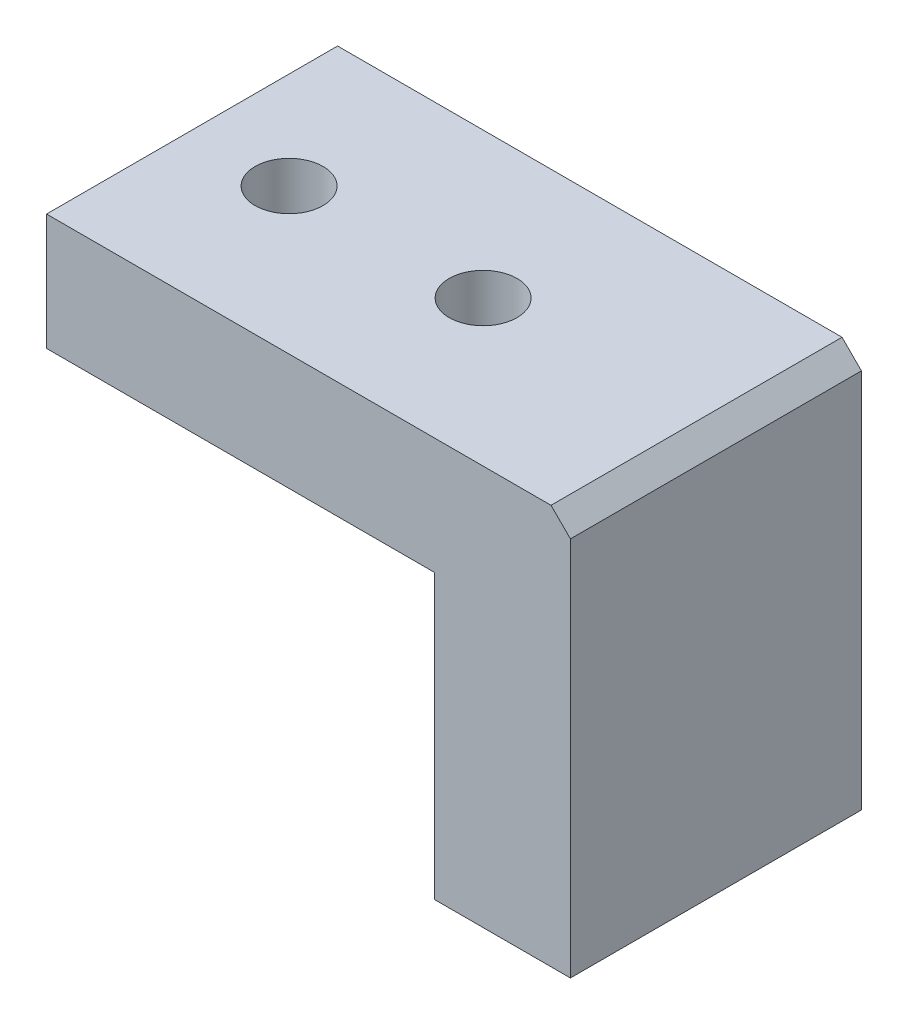
ISO-10303-21;
HEADER;
FILE_DESCRIPTION(('STEP AP214'),'2;1');
FILE_NAME('part.step','',(''),(''),'','','');
FILE_SCHEMA(('AUTOMOTIVE_DESIGN { 1 0 10303 214 1 1 1 1 }'));
ENDSEC;
DATA;
#1=APPLICATION_CONTEXT('core data for automotive mechanical design processes');
#2=APPLICATION_PROTOCOL_DEFINITION('international standard','automotive_design',2000,#1);
#3=PRODUCT_CONTEXT('',#1,'mechanical');
#4=PRODUCT('Part','Part','',(#3));
#5=PRODUCT_RELATED_PRODUCT_CATEGORY('part','',(#4));
#6=PRODUCT_DEFINITION_FORMATION('','',#4);
#7=PRODUCT_DEFINITION_CONTEXT('part definition',#1,'design');
#8=PRODUCT_DEFINITION('design','',#6,#7);
#9=PRODUCT_DEFINITION_SHAPE('','',#8);
#10=(LENGTH_UNIT() NAMED_UNIT(*) SI_UNIT(.MILLI.,.METRE.));
#11=(NAMED_UNIT(*) PLANE_ANGLE_UNIT() SI_UNIT($,.RADIAN.));
#12=(NAMED_UNIT(*) SI_UNIT($,.STERADIAN.) SOLID_ANGLE_UNIT());
#13=UNCERTAINTY_MEASURE_WITH_UNIT(LENGTH_MEASURE(1.E-05),#10,'distance_accuracy_value','');
#14=(GEOMETRIC_REPRESENTATION_CONTEXT(3) GLOBAL_UNCERTAINTY_ASSIGNED_CONTEXT((#13)) GLOBAL_UNIT_ASSIGNED_CONTEXT((#10,
#11,#12)) REPRESENTATION_CONTEXT('',''));
#15=CARTESIAN_POINT('',(0.,0.,0.));
#16=DIRECTION('',(0.,0.,1.));
#17=DIRECTION('',(1.,0.,0.));
#18=AXIS2_PLACEMENT_3D('',#15,#16,#17);
#19=CARTESIAN_POINT('',(-9.66220735785953,0.,15.));
#20=DIRECTION('',(1.,0.,0.));
#21=DIRECTION('',(0.,0.,-1.));
#22=AXIS2_PLACEMENT_3D('',#19,#20,#21);
#23=PLANE('',#22);
#24=DIRECTION('',(0.,-1.,0.));
#25=VECTOR('',#24,1.);
#26=CARTESIAN_POINT('',(-9.66220735785953,0.,0.));
#27=LINE('',#26,#25);
#28=CARTESIAN_POINT('',(-9.66220735785953,6.,0.));
#29=VERTEX_POINT('',#28);
#30=CARTESIAN_POINT('',(-9.66220735785953,0.,0.));
#31=VERTEX_POINT('',#30);
#32=EDGE_CURVE('E115',#29,#31,#27,.T.);
#33=ORIENTED_EDGE('',*,*,#32,.T.);
#34=DIRECTION('',(0.,0.,-1.));
#35=VECTOR('',#34,1.);
#36=CARTESIAN_POINT('',(-9.66220735785953,0.,15.));
#37=LINE('',#36,#35);
#38=CARTESIAN_POINT('',(-9.66220735785953,0.,15.));
#39=VERTEX_POINT('',#38);
#40=EDGE_CURVE('E96',#39,#31,#37,.T.);
#41=ORIENTED_EDGE('',*,*,#40,.F.);
#42=DIRECTION('',(0.,-1.,0.));
#43=VECTOR('',#42,1.);
#44=CARTESIAN_POINT('',(-9.66220735785953,0.,15.));
#45=LINE('',#44,#43);
#46=CARTESIAN_POINT('',(-9.66220735785953,6.,15.));
#47=VERTEX_POINT('',#46);
#48=EDGE_CURVE('E103',#47,#39,#45,.T.);
#49=ORIENTED_EDGE('',*,*,#48,.F.);
#50=DIRECTION('',(0.,0.,-1.));
#51=VECTOR('',#50,1.);
#52=CARTESIAN_POINT('',(-9.66220735785953,6.,15.));
#53=LINE('',#52,#51);
#54=EDGE_CURVE('E129',#47,#29,#53,.T.);
#55=ORIENTED_EDGE('',*,*,#54,.T.);
#56=EDGE_LOOP('',(#33,#41,#49,#55));
#57=FACE_BOUND('',#56,.T.);
#58=ADVANCED_FACE('F33',(#57),#23,.F.);
#59=CARTESIAN_POINT('',(10.3377926421405,0.,15.));
#60=DIRECTION('',(0.,1.,0.));
#61=DIRECTION('',(0.,0.,1.));
#62=AXIS2_PLACEMENT_3D('',#59,#60,#61);
#63=PLANE('',#62);
#64=CARTESIAN_POINT('',(5.33779264214047,0.,7.5));
#65=DIRECTION('',(0.,-1.,0.));
#66=DIRECTION('',(0.,0.,-1.));
#67=AXIS2_PLACEMENT_3D('',#64,#65,#66);
#68=CIRCLE('',#67,1.75);
#69=CARTESIAN_POINT('',(5.33779264214047,0.,5.75));
#70=VERTEX_POINT('',#69);
#71=EDGE_CURVE('E154',#70,#70,#68,.T.);
#72=ORIENTED_EDGE('',*,*,#71,.F.);
#73=EDGE_LOOP('',(#72));
#74=FACE_BOUND('',#73,.T.);
#75=CARTESIAN_POINT('',(-4.66220735785953,0.,7.5));
#76=DIRECTION('',(0.,-1.,0.));
#77=DIRECTION('',(0.,0.,-1.));
#78=AXIS2_PLACEMENT_3D('',#75,#76,#77);
#79=CIRCLE('',#78,1.75);
#80=CARTESIAN_POINT('',(-4.66220735785953,0.,5.75));
#81=VERTEX_POINT('',#80);
#82=EDGE_CURVE('E148',#81,#81,#79,.T.);
#83=ORIENTED_EDGE('',*,*,#82,.F.);
#84=EDGE_LOOP('',(#83));
#85=FACE_BOUND('',#84,.T.);
#86=DIRECTION('',(1.,0.,0.));
#87=VECTOR('',#86,1.);
#88=CARTESIAN_POINT('',(10.3377926421405,0.,0.));
#89=LINE('',#88,#87);
#90=CARTESIAN_POINT('',(10.3377926421405,0.,0.));
#91=VERTEX_POINT('',#90);
#92=EDGE_CURVE('E138',#31,#91,#89,.T.);
#93=ORIENTED_EDGE('',*,*,#92,.T.);
#94=DIRECTION('',(0.,0.,-1.));
#95=VECTOR('',#94,1.);
#96=CARTESIAN_POINT('',(10.3377926421405,0.,15.));
#97=LINE('',#96,#95);
#98=CARTESIAN_POINT('',(10.3377926421405,0.,15.));
#99=VERTEX_POINT('',#98);
#100=EDGE_CURVE('E99',#99,#91,#97,.T.);
#101=ORIENTED_EDGE('',*,*,#100,.F.);
#102=DIRECTION('',(1.,0.,0.));
#103=VECTOR('',#102,1.);
#104=CARTESIAN_POINT('',(10.3377926421405,0.,15.));
#105=LINE('',#104,#103);
#106=EDGE_CURVE('E92',#39,#99,#105,.T.);
#107=ORIENTED_EDGE('',*,*,#106,.F.);
#108=ORIENTED_EDGE('',*,*,#40,.T.);
#109=EDGE_LOOP('',(#93,#101,#107,#108));
#110=FACE_BOUND('',#109,.T.);
#111=ADVANCED_FACE('F94',(#74,#85,#110),#63,.F.);
#112=CARTESIAN_POINT('',(10.3377926421405,-14.6,15.));
#113=DIRECTION('',(1.,0.,0.));
#114=DIRECTION('',(0.,0.,-1.));
#115=AXIS2_PLACEMENT_3D('',#112,#113,#114);
#116=PLANE('',#115);
#117=DIRECTION('',(0.,-1.,0.));
#118=VECTOR('',#117,1.);
#119=CARTESIAN_POINT('',(10.3377926421405,-14.6,0.));
#120=LINE('',#119,#118);
#121=CARTESIAN_POINT('',(10.3377926421405,-14.6,0.));
#122=VERTEX_POINT('',#121);
#123=EDGE_CURVE('E136',#91,#122,#120,.T.);
#124=ORIENTED_EDGE('',*,*,#123,.T.);
#125=DIRECTION('',(0.,0.,-1.));
#126=VECTOR('',#125,1.);
#127=CARTESIAN_POINT('',(10.3377926421405,-14.6,15.));
#128=LINE('',#127,#126);
#129=CARTESIAN_POINT('',(10.3377926421405,-14.6,15.));
#130=VERTEX_POINT('',#129);
#131=EDGE_CURVE('E120',#130,#122,#128,.T.);
#132=ORIENTED_EDGE('',*,*,#131,.F.);
#133=DIRECTION('',(0.,-1.,0.));
#134=VECTOR('',#133,1.);
#135=CARTESIAN_POINT('',(10.3377926421405,-14.6,15.));
#136=LINE('',#135,#134);
#137=EDGE_CURVE('E102',#99,#130,#136,.T.);
#138=ORIENTED_EDGE('',*,*,#137,.F.);
#139=ORIENTED_EDGE('',*,*,#100,.T.);
#140=EDGE_LOOP('',(#124,#132,#138,#139));
#141=FACE_BOUND('',#140,.T.);
#142=ADVANCED_FACE('F172',(#141),#116,.F.);
#143=CARTESIAN_POINT('',(17.3377926421405,-14.6,15.));
#144=DIRECTION('',(0.,1.,0.));
#145=DIRECTION('',(-1.,0.,0.));
#146=AXIS2_PLACEMENT_3D('',#143,#144,#145);
#147=PLANE('',#146);
#148=DIRECTION('',(1.,0.,0.));
#149=VECTOR('',#148,1.);
#150=CARTESIAN_POINT('',(17.3377926421405,-14.6,0.));
#151=LINE('',#150,#149);
#152=CARTESIAN_POINT('',(17.3377926421405,-14.6,0.));
#153=VERTEX_POINT('',#152);
#154=EDGE_CURVE('E134',#122,#153,#151,.T.);
#155=ORIENTED_EDGE('',*,*,#154,.T.);
#156=DIRECTION('',(0.,0.,-1.));
#157=VECTOR('',#156,1.);
#158=CARTESIAN_POINT('',(17.3377926421405,-14.6,15.));
#159=LINE('',#158,#157);
#160=CARTESIAN_POINT('',(17.3377926421405,-14.6,15.));
#161=VERTEX_POINT('',#160);
#162=EDGE_CURVE('E126',#161,#153,#159,.T.);
#163=ORIENTED_EDGE('',*,*,#162,.F.);
#164=DIRECTION('',(1.,0.,0.));
#165=VECTOR('',#164,1.);
#166=CARTESIAN_POINT('',(17.3377926421405,-14.6,15.));
#167=LINE('',#166,#165);
#168=EDGE_CURVE('E145',#130,#161,#167,.T.);
#169=ORIENTED_EDGE('',*,*,#168,.F.);
#170=ORIENTED_EDGE('',*,*,#131,.T.);
#171=EDGE_LOOP('',(#155,#163,#169,#170));
#172=FACE_BOUND('',#171,.T.);
#173=ADVANCED_FACE('F192',(#172),#147,.F.);
#174=CARTESIAN_POINT('',(17.3377926421405,6.,15.));
#175=DIRECTION('',(-1.,0.,0.));
#176=DIRECTION('',(0.,0.,1.));
#177=AXIS2_PLACEMENT_3D('',#174,#175,#176);
#178=PLANE('',#177);
#179=DIRECTION('',(0.,1.,0.));
#180=VECTOR('',#179,1.);
#181=CARTESIAN_POINT('',(17.3377926421405,6.,0.));
#182=LINE('',#181,#180);
#183=CARTESIAN_POINT('',(17.3377926421405,5.,0.));
#184=VERTEX_POINT('',#183);
#185=EDGE_CURVE('E132',#153,#184,#182,.T.);
#186=ORIENTED_EDGE('',*,*,#185,.T.);
#187=DIRECTION('',(0.,0.,1.));
#188=VECTOR('',#187,1.);
#189=CARTESIAN_POINT('',(17.3377926421405,5.,15.));
#190=LINE('',#189,#188);
#191=CARTESIAN_POINT('',(17.3377926421405,5.,15.));
#192=VERTEX_POINT('',#191);
#193=EDGE_CURVE('E41',#184,#192,#190,.T.);
#194=ORIENTED_EDGE('',*,*,#193,.T.);
#195=DIRECTION('',(0.,1.,0.));
#196=VECTOR('',#195,1.);
#197=CARTESIAN_POINT('',(17.3377926421405,6.,15.));
#198=LINE('',#197,#196);
#199=EDGE_CURVE('E143',#161,#192,#198,.T.);
#200=ORIENTED_EDGE('',*,*,#199,.F.);
#201=ORIENTED_EDGE('',*,*,#162,.T.);
#202=EDGE_LOOP('',(#186,#194,#200,#201));
#203=FACE_BOUND('',#202,.T.);
#204=ADVANCED_FACE('F196',(#203),#178,.F.);
#205=CARTESIAN_POINT('',(-9.66220735785953,6.,15.));
#206=DIRECTION('',(0.,-1.,0.));
#207=DIRECTION('',(1.,0.,0.));
#208=AXIS2_PLACEMENT_3D('',#205,#206,#207);
#209=PLANE('',#208);
#210=CARTESIAN_POINT('',(5.33779264214047,6.,7.5));
#211=DIRECTION('',(0.,-1.,0.));
#212=DIRECTION('',(0.,0.,-1.));
#213=AXIS2_PLACEMENT_3D('',#210,#211,#212);
#214=CIRCLE('',#213,1.75);
#215=CARTESIAN_POINT('',(5.33779264214047,6.,5.75));
#216=VERTEX_POINT('',#215);
#217=EDGE_CURVE('E151',#216,#216,#214,.T.);
#218=ORIENTED_EDGE('',*,*,#217,.T.);
#219=EDGE_LOOP('',(#218));
#220=FACE_BOUND('',#219,.T.);
#221=CARTESIAN_POINT('',(-4.66220735785953,6.,7.5));
#222=DIRECTION('',(0.,-1.,0.));
#223=DIRECTION('',(0.,0.,-1.));
#224=AXIS2_PLACEMENT_3D('',#221,#222,#223);
#225=CIRCLE('',#224,1.75);
#226=CARTESIAN_POINT('',(-4.66220735785953,6.,5.75));
#227=VERTEX_POINT('',#226);
#228=EDGE_CURVE('E141',#227,#227,#225,.T.);
#229=ORIENTED_EDGE('',*,*,#228,.T.);
#230=EDGE_LOOP('',(#229));
#231=FACE_BOUND('',#230,.T.);
#232=DIRECTION('',(-1.,0.,0.));
#233=VECTOR('',#232,1.);
#234=CARTESIAN_POINT('',(-9.66220735785953,6.,15.));
#235=LINE('',#234,#233);
#236=CARTESIAN_POINT('',(16.3377926421405,6.,15.));
#237=VERTEX_POINT('',#236);
#238=EDGE_CURVE('E108',#237,#47,#235,.T.);
#239=ORIENTED_EDGE('',*,*,#238,.F.);
#240=DIRECTION('',(0.,0.,-1.));
#241=VECTOR('',#240,1.);
#242=CARTESIAN_POINT('',(16.3377926421405,6.,15.));
#243=LINE('',#242,#241);
#244=CARTESIAN_POINT('',(16.3377926421405,6.,0.));
#245=VERTEX_POINT('',#244);
#246=EDGE_CURVE('E116',#237,#245,#243,.T.);
#247=ORIENTED_EDGE('',*,*,#246,.T.);
#248=DIRECTION('',(-1.,0.,0.));
#249=VECTOR('',#248,1.);
#250=CARTESIAN_POINT('',(-9.66220735785953,6.,0.));
#251=LINE('',#250,#249);
#252=EDGE_CURVE('E112',#245,#29,#251,.T.);
#253=ORIENTED_EDGE('',*,*,#252,.T.);
#254=ORIENTED_EDGE('',*,*,#54,.F.);
#255=EDGE_LOOP('',(#239,#247,#253,#254));
#256=FACE_BOUND('',#255,.T.);
#257=ADVANCED_FACE('F160',(#220,#231,#256),#209,.F.);
#258=CARTESIAN_POINT('',(0.,0.,15.));
#259=DIRECTION('',(0.,0.,-1.));
#260=DIRECTION('',(-1.,0.,0.));
#261=AXIS2_PLACEMENT_3D('',#258,#259,#260);
#262=PLANE('',#261);
#263=ORIENTED_EDGE('',*,*,#199,.T.);
#264=DIRECTION('',(0.707106781186546,-0.707106781186549,0.));
#265=VECTOR('',#264,1.);
#266=CARTESIAN_POINT('',(16.3377926421405,6.,15.));
#267=LINE('',#266,#265);
#268=EDGE_CURVE('E11',#192,#237,#267,.F.);
#269=ORIENTED_EDGE('',*,*,#268,.T.);
#270=ORIENTED_EDGE('',*,*,#238,.T.);
#271=ORIENTED_EDGE('',*,*,#48,.T.);
#272=ORIENTED_EDGE('',*,*,#106,.T.);
#273=ORIENTED_EDGE('',*,*,#137,.T.);
#274=ORIENTED_EDGE('',*,*,#168,.T.);
#275=EDGE_LOOP('',(#263,#269,#270,#271,#272,#273,#274));
#276=FACE_BOUND('',#275,.T.);
#277=ADVANCED_FACE('F106',(#276),#262,.F.);
#278=CARTESIAN_POINT('',(0.,0.,0.));
#279=DIRECTION('',(0.,0.,-1.));
#280=DIRECTION('',(-1.,0.,0.));
#281=AXIS2_PLACEMENT_3D('',#278,#279,#280);
#282=PLANE('',#281);
#283=ORIENTED_EDGE('',*,*,#252,.F.);
#284=DIRECTION('',(-0.707106781186546,0.707106781186549,0.));
#285=VECTOR('',#284,1.);
#286=CARTESIAN_POINT('',(11.1688963210703,11.1688963210702,0.));
#287=LINE('',#286,#285);
#288=EDGE_CURVE('E55',#245,#184,#287,.F.);
#289=ORIENTED_EDGE('',*,*,#288,.T.);
#290=ORIENTED_EDGE('',*,*,#185,.F.);
#291=ORIENTED_EDGE('',*,*,#154,.F.);
#292=ORIENTED_EDGE('',*,*,#123,.F.);
#293=ORIENTED_EDGE('',*,*,#92,.F.);
#294=ORIENTED_EDGE('',*,*,#32,.F.);
#295=EDGE_LOOP('',(#283,#289,#290,#291,#292,#293,#294));
#296=FACE_BOUND('',#295,.T.);
#297=ADVANCED_FACE('F182',(#296),#282,.T.);
#298=CARTESIAN_POINT('',(16.3377926421405,6.,15.));
#299=DIRECTION('',(-0.707106781186549,-0.707106781186546,0.));
#300=DIRECTION('',(0.,0.,-1.));
#301=AXIS2_PLACEMENT_3D('',#298,#299,#300);
#302=PLANE('',#301);
#303=ORIENTED_EDGE('',*,*,#268,.F.);
#304=ORIENTED_EDGE('',*,*,#193,.F.);
#305=ORIENTED_EDGE('',*,*,#288,.F.);
#306=ORIENTED_EDGE('',*,*,#246,.F.);
#307=EDGE_LOOP('',(#303,#304,#305,#306));
#308=FACE_BOUND('',#307,.T.);
#309=ADVANCED_FACE('F35',(#308),#302,.F.);
#310=CARTESIAN_POINT('',(-4.66220735785953,6.,7.5));
#311=DIRECTION('',(0.,-1.,0.));
#312=DIRECTION('',(0.,0.,-1.));
#313=AXIS2_PLACEMENT_3D('',#310,#311,#312);
#314=CYLINDRICAL_SURFACE('',#313,1.75);
#315=ORIENTED_EDGE('',*,*,#228,.F.);
#316=EDGE_LOOP('',(#315));
#317=FACE_BOUND('',#316,.T.);
#318=ORIENTED_EDGE('',*,*,#82,.T.);
#319=EDGE_LOOP('',(#318));
#320=FACE_BOUND('',#319,.T.);
#321=ADVANCED_FACE('F166',(#317,#320),#314,.F.);
#322=CARTESIAN_POINT('',(5.33779264214047,6.,7.5));
#323=DIRECTION('',(0.,-1.,0.));
#324=DIRECTION('',(0.,0.,-1.));
#325=AXIS2_PLACEMENT_3D('',#322,#323,#324);
#326=CYLINDRICAL_SURFACE('',#325,1.75);
#327=ORIENTED_EDGE('',*,*,#217,.F.);
#328=EDGE_LOOP('',(#327));
#329=FACE_BOUND('',#328,.T.);
#330=ORIENTED_EDGE('',*,*,#71,.T.);
#331=EDGE_LOOP('',(#330));
#332=FACE_BOUND('',#331,.T.);
#333=ADVANCED_FACE('F163',(#329,#332),#326,.F.);
#334=CLOSED_SHELL('',(#58,#111,#142,#173,#204,#257,#277,#297,#309,#321,#333));
#335=MANIFOLD_SOLID_BREP('B2',#334);
#336=ADVANCED_BREP_SHAPE_REPRESENTATION('',(#18,#335),#14);
#337=SHAPE_DEFINITION_REPRESENTATION(#9,#336);
ENDSEC;
END-ISO-10303-21;
